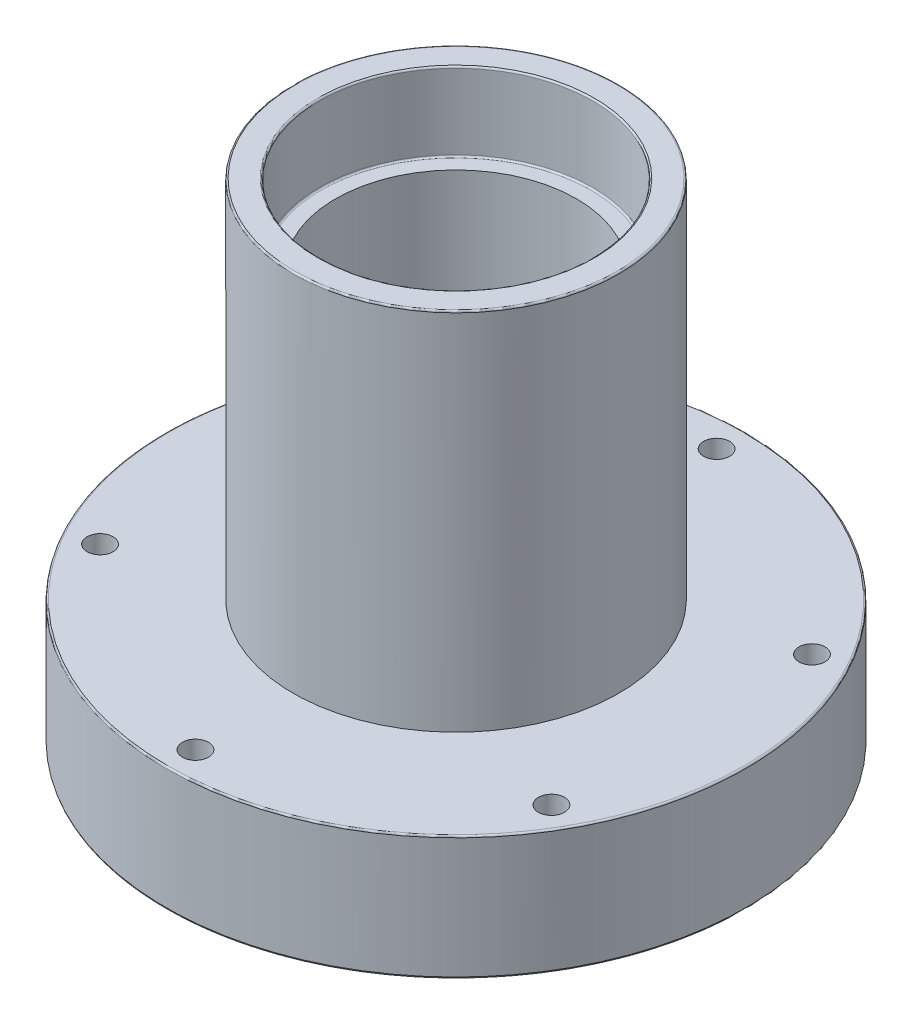
ISO-10303-21;
HEADER;
FILE_DESCRIPTION(('STEP AP214'),'2;1');
FILE_NAME('part.step','',(''),(''),'','','');
FILE_SCHEMA(('AUTOMOTIVE_DESIGN { 1 0 10303 214 1 1 1 1 }'));
ENDSEC;
DATA;
#1=APPLICATION_CONTEXT('core data for automotive mechanical design processes');
#2=APPLICATION_PROTOCOL_DEFINITION('international standard','automotive_design',2000,#1);
#3=PRODUCT_CONTEXT('',#1,'mechanical');
#4=PRODUCT('Part','Part','',(#3));
#5=PRODUCT_RELATED_PRODUCT_CATEGORY('part','',(#4));
#6=PRODUCT_DEFINITION_FORMATION('','',#4);
#7=PRODUCT_DEFINITION_CONTEXT('part definition',#1,'design');
#8=PRODUCT_DEFINITION('design','',#6,#7);
#9=PRODUCT_DEFINITION_SHAPE('','',#8);
#10=(LENGTH_UNIT() NAMED_UNIT(*) SI_UNIT(.MILLI.,.METRE.));
#11=(NAMED_UNIT(*) PLANE_ANGLE_UNIT() SI_UNIT($,.RADIAN.));
#12=(NAMED_UNIT(*) SI_UNIT($,.STERADIAN.) SOLID_ANGLE_UNIT());
#13=UNCERTAINTY_MEASURE_WITH_UNIT(LENGTH_MEASURE(1.E-05),#10,'distance_accuracy_value','');
#14=(GEOMETRIC_REPRESENTATION_CONTEXT(3) GLOBAL_UNCERTAINTY_ASSIGNED_CONTEXT((#13)) GLOBAL_UNIT_ASSIGNED_CONTEXT((#10,
#11,#12)) REPRESENTATION_CONTEXT('',''));
#15=CARTESIAN_POINT('',(0.,0.,0.));
#16=DIRECTION('',(0.,0.,1.));
#17=DIRECTION('',(1.,0.,0.));
#18=AXIS2_PLACEMENT_3D('',#15,#16,#17);
#19=CARTESIAN_POINT('',(0.,0.,-21.));
#20=DIRECTION('',(0.,-1.,0.));
#21=DIRECTION('',(0.,0.,-1.));
#22=AXIS2_PLACEMENT_3D('',#19,#20,#21);
#23=PLANE('',#22);
#24=CARTESIAN_POINT('',(0.,0.,0.));
#25=DIRECTION('',(0.,-1.,0.));
#26=DIRECTION('',(0.,0.,-1.));
#27=AXIS2_PLACEMENT_3D('',#24,#25,#26);
#28=CIRCLE('',#27,44.25);
#29=CARTESIAN_POINT('',(0.,0.,-44.25));
#30=VERTEX_POINT('',#29);
#31=EDGE_CURVE('E65',#30,#30,#28,.T.);
#32=ORIENTED_EDGE('',*,*,#31,.T.);
#33=EDGE_LOOP('',(#32));
#34=FACE_BOUND('',#33,.T.);
#35=CARTESIAN_POINT('',(0.,0.,-40.));
#36=DIRECTION('',(0.,1.,0.));
#37=DIRECTION('',(0.,0.,1.));
#38=AXIS2_PLACEMENT_3D('',#35,#36,#37);
#39=CIRCLE('',#38,2.);
#40=CARTESIAN_POINT('',(0.,0.,-38.));
#41=VERTEX_POINT('',#40);
#42=EDGE_CURVE('E89',#41,#41,#39,.T.);
#43=ORIENTED_EDGE('',*,*,#42,.T.);
#44=EDGE_LOOP('',(#43));
#45=FACE_BOUND('',#44,.T.);
#46=CARTESIAN_POINT('',(-34.6410161513776,0.,-20.));
#47=DIRECTION('',(0.,1.,0.));
#48=DIRECTION('',(0.,0.,1.));
#49=AXIS2_PLACEMENT_3D('',#46,#47,#48);
#50=CIRCLE('',#49,2.);
#51=CARTESIAN_POINT('',(-34.6410161513776,0.,-18.));
#52=VERTEX_POINT('',#51);
#53=EDGE_CURVE('E94',#52,#52,#50,.T.);
#54=ORIENTED_EDGE('',*,*,#53,.T.);
#55=EDGE_LOOP('',(#54));
#56=FACE_BOUND('',#55,.T.);
#57=CARTESIAN_POINT('',(-34.6410161513776,0.,20.));
#58=DIRECTION('',(0.,1.,0.));
#59=DIRECTION('',(0.,0.,1.));
#60=AXIS2_PLACEMENT_3D('',#57,#58,#59);
#61=CIRCLE('',#60,2.);
#62=CARTESIAN_POINT('',(-34.6410161513776,0.,22.));
#63=VERTEX_POINT('',#62);
#64=EDGE_CURVE('E93',#63,#63,#61,.T.);
#65=ORIENTED_EDGE('',*,*,#64,.T.);
#66=EDGE_LOOP('',(#65));
#67=FACE_BOUND('',#66,.T.);
#68=CARTESIAN_POINT('',(0.,0.,40.));
#69=DIRECTION('',(0.,1.,0.));
#70=DIRECTION('',(0.,0.,1.));
#71=AXIS2_PLACEMENT_3D('',#68,#69,#70);
#72=CIRCLE('',#71,2.);
#73=CARTESIAN_POINT('',(0.,0.,42.));
#74=VERTEX_POINT('',#73);
#75=EDGE_CURVE('E100',#74,#74,#72,.T.);
#76=ORIENTED_EDGE('',*,*,#75,.T.);
#77=EDGE_LOOP('',(#76));
#78=FACE_BOUND('',#77,.T.);
#79=CARTESIAN_POINT('',(34.6410161513776,0.,20.));
#80=DIRECTION('',(0.,1.,0.));
#81=DIRECTION('',(0.,0.,1.));
#82=AXIS2_PLACEMENT_3D('',#79,#80,#81);
#83=CIRCLE('',#82,2.00000000000001);
#84=CARTESIAN_POINT('',(34.6410161513776,0.,22.));
#85=VERTEX_POINT('',#84);
#86=EDGE_CURVE('E106',#85,#85,#83,.T.);
#87=ORIENTED_EDGE('',*,*,#86,.T.);
#88=EDGE_LOOP('',(#87));
#89=FACE_BOUND('',#88,.T.);
#90=CARTESIAN_POINT('',(34.6410161513775,0.,-20.));
#91=DIRECTION('',(0.,1.,0.));
#92=DIRECTION('',(0.,0.,1.));
#93=AXIS2_PLACEMENT_3D('',#90,#91,#92);
#94=CIRCLE('',#93,2.);
#95=CARTESIAN_POINT('',(34.6410161513775,0.,-18.));
#96=VERTEX_POINT('',#95);
#97=EDGE_CURVE('E112',#96,#96,#94,.T.);
#98=ORIENTED_EDGE('',*,*,#97,.T.);
#99=EDGE_LOOP('',(#98));
#100=FACE_BOUND('',#99,.T.);
#101=CARTESIAN_POINT('',(0.,0.,0.));
#102=DIRECTION('',(0.,-1.,0.));
#103=DIRECTION('',(0.,0.,-1.));
#104=AXIS2_PLACEMENT_3D('',#101,#102,#103);
#105=CIRCLE('',#104,21.);
#106=CARTESIAN_POINT('',(0.,0.,-21.));
#107=VERTEX_POINT('',#106);
#108=EDGE_CURVE('E77',#107,#107,#105,.T.);
#109=ORIENTED_EDGE('',*,*,#108,.F.);
#110=EDGE_LOOP('',(#109));
#111=FACE_BOUND('',#110,.T.);
#112=ADVANCED_FACE('F33',(#34,#45,#56,#67,#78,#89,#100,#111),#23,.T.);
#113=CARTESIAN_POINT('',(0.,-1000.23728813559,0.));
#114=DIRECTION('',(0.,-1.,0.));
#115=DIRECTION('',(0.,0.,-1.));
#116=AXIS2_PLACEMENT_3D('',#113,#114,#115);
#117=CYLINDRICAL_SURFACE('',#116,21.);
#118=CARTESIAN_POINT('',(0.,11.7499999999999,0.));
#119=DIRECTION('',(0.,-1.,0.));
#120=DIRECTION('',(0.,0.,-1.));
#121=AXIS2_PLACEMENT_3D('',#118,#119,#120);
#122=CIRCLE('',#121,21.);
#123=CARTESIAN_POINT('',(0.,11.7499999999999,-21.));
#124=VERTEX_POINT('',#123);
#125=EDGE_CURVE('E10',#124,#124,#122,.F.);
#126=ORIENTED_EDGE('',*,*,#125,.T.);
#127=EDGE_LOOP('',(#126));
#128=FACE_BOUND('',#127,.T.);
#129=ORIENTED_EDGE('',*,*,#108,.T.);
#130=EDGE_LOOP('',(#129));
#131=FACE_BOUND('',#130,.T.);
#132=ADVANCED_FACE('F166',(#128,#131),#117,.F.);
#133=CARTESIAN_POINT('',(0.,12.,-21.));
#134=DIRECTION('',(0.,-1.,0.));
#135=DIRECTION('',(0.,0.,-1.));
#136=AXIS2_PLACEMENT_3D('',#133,#134,#135);
#137=PLANE('',#136);
#138=CARTESIAN_POINT('',(0.,12.,0.));
#139=DIRECTION('',(0.,-1.,0.));
#140=DIRECTION('',(0.,0.,-1.));
#141=AXIS2_PLACEMENT_3D('',#138,#139,#140);
#142=CIRCLE('',#141,20.75);
#143=CARTESIAN_POINT('',(0.,12.,-20.75));
#144=VERTEX_POINT('',#143);
#145=EDGE_CURVE('E40',#144,#144,#142,.T.);
#146=ORIENTED_EDGE('',*,*,#145,.T.);
#147=EDGE_LOOP('',(#146));
#148=FACE_BOUND('',#147,.T.);
#149=CARTESIAN_POINT('',(0.,12.,0.));
#150=DIRECTION('',(0.,-1.,0.));
#151=DIRECTION('',(0.,0.,-1.));
#152=AXIS2_PLACEMENT_3D('',#149,#150,#151);
#153=CIRCLE('',#152,18.5);
#154=CARTESIAN_POINT('',(0.,12.,-18.5));
#155=VERTEX_POINT('',#154);
#156=EDGE_CURVE('E80',#155,#155,#153,.T.);
#157=ORIENTED_EDGE('',*,*,#156,.F.);
#158=EDGE_LOOP('',(#157));
#159=FACE_BOUND('',#158,.T.);
#160=ADVANCED_FACE('F172',(#148,#159),#137,.T.);
#161=CARTESIAN_POINT('',(0.,-1000.23728813559,0.));
#162=DIRECTION('',(0.,-1.,0.));
#163=DIRECTION('',(0.,0.,-1.));
#164=AXIS2_PLACEMENT_3D('',#161,#162,#163);
#165=CYLINDRICAL_SURFACE('',#164,18.5);
#166=ORIENTED_EDGE('',*,*,#156,.T.);
#167=EDGE_LOOP('',(#166));
#168=FACE_BOUND('',#167,.T.);
#169=CARTESIAN_POINT('',(0.,62.9999999999999,0.));
#170=DIRECTION('',(0.,-1.,0.));
#171=DIRECTION('',(0.,0.,-1.));
#172=AXIS2_PLACEMENT_3D('',#169,#170,#171);
#173=CIRCLE('',#172,18.5);
#174=CARTESIAN_POINT('',(0.,62.9999999999999,-18.5));
#175=VERTEX_POINT('',#174);
#176=EDGE_CURVE('E83',#175,#175,#173,.T.);
#177=ORIENTED_EDGE('',*,*,#176,.F.);
#178=EDGE_LOOP('',(#177));
#179=FACE_BOUND('',#178,.T.);
#180=ADVANCED_FACE('F208',(#168,#179),#165,.F.);
#181=CARTESIAN_POINT('',(0.,63.,-18.5));
#182=DIRECTION('',(0.,1.,0.));
#183=DIRECTION('',(0.,0.,1.));
#184=AXIS2_PLACEMENT_3D('',#181,#182,#183);
#185=PLANE('',#184);
#186=CARTESIAN_POINT('',(0.,63.,0.));
#187=DIRECTION('',(0.,1.,0.));
#188=DIRECTION('',(0.,0.,1.));
#189=AXIS2_PLACEMENT_3D('',#186,#187,#188);
#190=CIRCLE('',#189,20.75);
#191=CARTESIAN_POINT('',(0.,63.,20.75));
#192=VERTEX_POINT('',#191);
#193=EDGE_CURVE('E44',#192,#192,#190,.T.);
#194=ORIENTED_EDGE('',*,*,#193,.T.);
#195=EDGE_LOOP('',(#194));
#196=FACE_BOUND('',#195,.T.);
#197=ORIENTED_EDGE('',*,*,#176,.T.);
#198=EDGE_LOOP('',(#197));
#199=FACE_BOUND('',#198,.T.);
#200=ADVANCED_FACE('F202',(#196,#199),#185,.T.);
#201=CARTESIAN_POINT('',(0.,-1000.23728813559,0.));
#202=DIRECTION('',(0.,-1.,0.));
#203=DIRECTION('',(0.,0.,-1.));
#204=AXIS2_PLACEMENT_3D('',#201,#202,#203);
#205=CYLINDRICAL_SURFACE('',#204,21.);
#206=CARTESIAN_POINT('',(0.,74.7500000000001,0.));
#207=DIRECTION('',(0.,1.,0.));
#208=DIRECTION('',(0.,0.,1.));
#209=AXIS2_PLACEMENT_3D('',#206,#207,#208);
#210=CIRCLE('',#209,21.);
#211=CARTESIAN_POINT('',(0.,74.7500000000001,21.));
#212=VERTEX_POINT('',#211);
#213=EDGE_CURVE('E48',#212,#212,#210,.T.);
#214=ORIENTED_EDGE('',*,*,#213,.T.);
#215=EDGE_LOOP('',(#214));
#216=FACE_BOUND('',#215,.T.);
#217=CARTESIAN_POINT('',(0.,63.25,0.));
#218=DIRECTION('',(0.,1.,0.));
#219=DIRECTION('',(0.,0.,1.));
#220=AXIS2_PLACEMENT_3D('',#217,#218,#219);
#221=CIRCLE('',#220,21.);
#222=CARTESIAN_POINT('',(0.,63.25,21.));
#223=VERTEX_POINT('',#222);
#224=EDGE_CURVE('E53',#223,#223,#221,.F.);
#225=ORIENTED_EDGE('',*,*,#224,.T.);
#226=EDGE_LOOP('',(#225));
#227=FACE_BOUND('',#226,.T.);
#228=ADVANCED_FACE('F162',(#216,#227),#205,.F.);
#229=CARTESIAN_POINT('',(0.,75.,-21.));
#230=DIRECTION('',(0.,1.,0.));
#231=DIRECTION('',(0.,0.,1.));
#232=AXIS2_PLACEMENT_3D('',#229,#230,#231);
#233=PLANE('',#232);
#234=CARTESIAN_POINT('',(0.,75.,0.));
#235=DIRECTION('',(0.,1.,0.));
#236=DIRECTION('',(0.,0.,1.));
#237=AXIS2_PLACEMENT_3D('',#234,#235,#236);
#238=CIRCLE('',#237,24.75);
#239=CARTESIAN_POINT('',(0.,75.,24.75));
#240=VERTEX_POINT('',#239);
#241=EDGE_CURVE('E56',#240,#240,#238,.T.);
#242=ORIENTED_EDGE('',*,*,#241,.T.);
#243=EDGE_LOOP('',(#242));
#244=FACE_BOUND('',#243,.T.);
#245=CARTESIAN_POINT('',(0.,75.,0.));
#246=DIRECTION('',(0.,1.,0.));
#247=DIRECTION('',(0.,0.,1.));
#248=AXIS2_PLACEMENT_3D('',#245,#246,#247);
#249=CIRCLE('',#248,21.25);
#250=CARTESIAN_POINT('',(0.,75.,21.25));
#251=VERTEX_POINT('',#250);
#252=EDGE_CURVE('E59',#251,#251,#249,.F.);
#253=ORIENTED_EDGE('',*,*,#252,.T.);
#254=EDGE_LOOP('',(#253));
#255=FACE_BOUND('',#254,.T.);
#256=ADVANCED_FACE('F156',(#244,#255),#233,.T.);
#257=CARTESIAN_POINT('',(0.,-1000.23728813559,0.));
#258=DIRECTION('',(0.,-1.,0.));
#259=DIRECTION('',(0.,0.,-1.));
#260=AXIS2_PLACEMENT_3D('',#257,#258,#259);
#261=CYLINDRICAL_SURFACE('',#260,25.);
#262=CARTESIAN_POINT('',(0.,74.7500000000001,0.));
#263=DIRECTION('',(0.,1.,0.));
#264=DIRECTION('',(0.,0.,1.));
#265=AXIS2_PLACEMENT_3D('',#262,#263,#264);
#266=CIRCLE('',#265,25.);
#267=CARTESIAN_POINT('',(0.,74.7500000000001,25.));
#268=VERTEX_POINT('',#267);
#269=EDGE_CURVE('E62',#268,#268,#266,.F.);
#270=ORIENTED_EDGE('',*,*,#269,.T.);
#271=EDGE_LOOP('',(#270));
#272=FACE_BOUND('',#271,.T.);
#273=CARTESIAN_POINT('',(0.,18.9999999999999,0.));
#274=DIRECTION('',(0.,-1.,0.));
#275=DIRECTION('',(0.,0.,-1.));
#276=AXIS2_PLACEMENT_3D('',#273,#274,#275);
#277=CIRCLE('',#276,25.);
#278=CARTESIAN_POINT('',(0.,18.9999999999999,-25.));
#279=VERTEX_POINT('',#278);
#280=EDGE_CURVE('E86',#279,#279,#277,.T.);
#281=ORIENTED_EDGE('',*,*,#280,.F.);
#282=EDGE_LOOP('',(#281));
#283=FACE_BOUND('',#282,.T.);
#284=ADVANCED_FACE('F140',(#272,#283),#261,.T.);
#285=CARTESIAN_POINT('',(0.,19.,-25.));
#286=DIRECTION('',(0.,1.,0.));
#287=DIRECTION('',(0.,0.,1.));
#288=AXIS2_PLACEMENT_3D('',#285,#286,#287);
#289=PLANE('',#288);
#290=CARTESIAN_POINT('',(0.,19.,0.));
#291=DIRECTION('',(0.,1.,0.));
#292=DIRECTION('',(0.,0.,1.));
#293=AXIS2_PLACEMENT_3D('',#290,#291,#292);
#294=CIRCLE('',#293,44.25);
#295=CARTESIAN_POINT('',(0.,19.,44.25));
#296=VERTEX_POINT('',#295);
#297=EDGE_CURVE('E68',#296,#296,#294,.T.);
#298=ORIENTED_EDGE('',*,*,#297,.T.);
#299=EDGE_LOOP('',(#298));
#300=FACE_BOUND('',#299,.T.);
#301=CARTESIAN_POINT('',(0.,19.,-40.));
#302=DIRECTION('',(0.,1.,0.));
#303=DIRECTION('',(0.,0.,1.));
#304=AXIS2_PLACEMENT_3D('',#301,#302,#303);
#305=CIRCLE('',#304,2.);
#306=CARTESIAN_POINT('',(0.,19.,-38.));
#307=VERTEX_POINT('',#306);
#308=EDGE_CURVE('E115',#307,#307,#305,.T.);
#309=ORIENTED_EDGE('',*,*,#308,.F.);
#310=EDGE_LOOP('',(#309));
#311=FACE_BOUND('',#310,.T.);
#312=CARTESIAN_POINT('',(-34.6410161513776,19.,-20.));
#313=DIRECTION('',(0.,1.,0.));
#314=DIRECTION('',(0.,0.,1.));
#315=AXIS2_PLACEMENT_3D('',#312,#313,#314);
#316=CIRCLE('',#315,2.);
#317=CARTESIAN_POINT('',(-34.6410161513776,19.,-18.));
#318=VERTEX_POINT('',#317);
#319=EDGE_CURVE('E116',#318,#318,#316,.T.);
#320=ORIENTED_EDGE('',*,*,#319,.F.);
#321=EDGE_LOOP('',(#320));
#322=FACE_BOUND('',#321,.T.);
#323=CARTESIAN_POINT('',(-34.6410161513776,19.,20.));
#324=DIRECTION('',(0.,1.,0.));
#325=DIRECTION('',(0.,0.,1.));
#326=AXIS2_PLACEMENT_3D('',#323,#324,#325);
#327=CIRCLE('',#326,2.);
#328=CARTESIAN_POINT('',(-34.6410161513776,19.,22.));
#329=VERTEX_POINT('',#328);
#330=EDGE_CURVE('E90',#329,#329,#327,.T.);
#331=ORIENTED_EDGE('',*,*,#330,.F.);
#332=EDGE_LOOP('',(#331));
#333=FACE_BOUND('',#332,.T.);
#334=CARTESIAN_POINT('',(0.,19.,40.));
#335=DIRECTION('',(0.,1.,0.));
#336=DIRECTION('',(0.,0.,1.));
#337=AXIS2_PLACEMENT_3D('',#334,#335,#336);
#338=CIRCLE('',#337,2.);
#339=CARTESIAN_POINT('',(0.,19.,42.));
#340=VERTEX_POINT('',#339);
#341=EDGE_CURVE('E97',#340,#340,#338,.T.);
#342=ORIENTED_EDGE('',*,*,#341,.F.);
#343=EDGE_LOOP('',(#342));
#344=FACE_BOUND('',#343,.T.);
#345=CARTESIAN_POINT('',(34.6410161513776,19.,20.));
#346=DIRECTION('',(0.,1.,0.));
#347=DIRECTION('',(0.,0.,1.));
#348=AXIS2_PLACEMENT_3D('',#345,#346,#347);
#349=CIRCLE('',#348,2.00000000000001);
#350=CARTESIAN_POINT('',(34.6410161513776,19.,22.));
#351=VERTEX_POINT('',#350);
#352=EDGE_CURVE('E103',#351,#351,#349,.T.);
#353=ORIENTED_EDGE('',*,*,#352,.F.);
#354=EDGE_LOOP('',(#353));
#355=FACE_BOUND('',#354,.T.);
#356=CARTESIAN_POINT('',(34.6410161513775,19.,-20.));
#357=DIRECTION('',(0.,1.,0.));
#358=DIRECTION('',(0.,0.,1.));
#359=AXIS2_PLACEMENT_3D('',#356,#357,#358);
#360=CIRCLE('',#359,2.);
#361=CARTESIAN_POINT('',(34.6410161513775,19.,-18.));
#362=VERTEX_POINT('',#361);
#363=EDGE_CURVE('E109',#362,#362,#360,.T.);
#364=ORIENTED_EDGE('',*,*,#363,.F.);
#365=EDGE_LOOP('',(#364));
#366=FACE_BOUND('',#365,.T.);
#367=ORIENTED_EDGE('',*,*,#280,.T.);
#368=EDGE_LOOP('',(#367));
#369=FACE_BOUND('',#368,.T.);
#370=ADVANCED_FACE('F136',(#300,#311,#322,#333,#344,#355,#366,#369),#289,.T.);
#371=CARTESIAN_POINT('',(0.,-1000.23728813559,0.));
#372=DIRECTION('',(0.,-1.,0.));
#373=DIRECTION('',(0.,0.,-1.));
#374=AXIS2_PLACEMENT_3D('',#371,#372,#373);
#375=CYLINDRICAL_SURFACE('',#374,44.5);
#376=CARTESIAN_POINT('',(0.,18.75,0.));
#377=DIRECTION('',(0.,1.,0.));
#378=DIRECTION('',(0.,0.,1.));
#379=AXIS2_PLACEMENT_3D('',#376,#377,#378);
#380=CIRCLE('',#379,44.5);
#381=CARTESIAN_POINT('',(0.,18.75,44.5));
#382=VERTEX_POINT('',#381);
#383=EDGE_CURVE('E71',#382,#382,#380,.F.);
#384=ORIENTED_EDGE('',*,*,#383,.T.);
#385=EDGE_LOOP('',(#384));
#386=FACE_BOUND('',#385,.T.);
#387=CARTESIAN_POINT('',(0.,0.250000000000083,0.));
#388=DIRECTION('',(0.,-1.,0.));
#389=DIRECTION('',(0.,0.,-1.));
#390=AXIS2_PLACEMENT_3D('',#387,#388,#389);
#391=CIRCLE('',#390,44.5);
#392=CARTESIAN_POINT('',(0.,0.250000000000083,-44.5));
#393=VERTEX_POINT('',#392);
#394=EDGE_CURVE('E74',#393,#393,#391,.F.);
#395=ORIENTED_EDGE('',*,*,#394,.T.);
#396=EDGE_LOOP('',(#395));
#397=FACE_BOUND('',#396,.T.);
#398=ADVANCED_FACE('F139',(#386,#397),#375,.T.);
#399=CARTESIAN_POINT('',(34.6410161513775,0.,-20.));
#400=DIRECTION('',(0.,1.,0.));
#401=DIRECTION('',(0.,0.,1.));
#402=AXIS2_PLACEMENT_3D('',#399,#400,#401);
#403=CYLINDRICAL_SURFACE('',#402,2.);
#404=ORIENTED_EDGE('',*,*,#97,.F.);
#405=EDGE_LOOP('',(#404));
#406=FACE_BOUND('',#405,.T.);
#407=ORIENTED_EDGE('',*,*,#363,.T.);
#408=EDGE_LOOP('',(#407));
#409=FACE_BOUND('',#408,.T.);
#410=ADVANCED_FACE('F262',(#406,#409),#403,.F.);
#411=CARTESIAN_POINT('',(34.6410161513776,0.,20.));
#412=DIRECTION('',(0.,1.,0.));
#413=DIRECTION('',(0.,0.,1.));
#414=AXIS2_PLACEMENT_3D('',#411,#412,#413);
#415=CYLINDRICAL_SURFACE('',#414,2.00000000000001);
#416=ORIENTED_EDGE('',*,*,#86,.F.);
#417=EDGE_LOOP('',(#416));
#418=FACE_BOUND('',#417,.T.);
#419=ORIENTED_EDGE('',*,*,#352,.T.);
#420=EDGE_LOOP('',(#419));
#421=FACE_BOUND('',#420,.T.);
#422=ADVANCED_FACE('F327',(#418,#421),#415,.F.);
#423=CARTESIAN_POINT('',(0.,0.,40.));
#424=DIRECTION('',(0.,1.,0.));
#425=DIRECTION('',(0.,0.,1.));
#426=AXIS2_PLACEMENT_3D('',#423,#424,#425);
#427=CYLINDRICAL_SURFACE('',#426,2.);
#428=ORIENTED_EDGE('',*,*,#75,.F.);
#429=EDGE_LOOP('',(#428));
#430=FACE_BOUND('',#429,.T.);
#431=ORIENTED_EDGE('',*,*,#341,.T.);
#432=EDGE_LOOP('',(#431));
#433=FACE_BOUND('',#432,.T.);
#434=ADVANCED_FACE('F319',(#430,#433),#427,.F.);
#435=CARTESIAN_POINT('',(-34.6410161513776,0.,20.));
#436=DIRECTION('',(0.,1.,0.));
#437=DIRECTION('',(0.,0.,1.));
#438=AXIS2_PLACEMENT_3D('',#435,#436,#437);
#439=CYLINDRICAL_SURFACE('',#438,2.);
#440=ORIENTED_EDGE('',*,*,#64,.F.);
#441=EDGE_LOOP('',(#440));
#442=FACE_BOUND('',#441,.T.);
#443=ORIENTED_EDGE('',*,*,#330,.T.);
#444=EDGE_LOOP('',(#443));
#445=FACE_BOUND('',#444,.T.);
#446=ADVANCED_FACE('F311',(#442,#445),#439,.F.);
#447=CARTESIAN_POINT('',(-34.6410161513776,0.,-20.));
#448=DIRECTION('',(0.,1.,0.));
#449=DIRECTION('',(0.,0.,1.));
#450=AXIS2_PLACEMENT_3D('',#447,#448,#449);
#451=CYLINDRICAL_SURFACE('',#450,2.);
#452=ORIENTED_EDGE('',*,*,#53,.F.);
#453=EDGE_LOOP('',(#452));
#454=FACE_BOUND('',#453,.T.);
#455=ORIENTED_EDGE('',*,*,#319,.T.);
#456=EDGE_LOOP('',(#455));
#457=FACE_BOUND('',#456,.T.);
#458=ADVANCED_FACE('F132',(#454,#457),#451,.F.);
#459=CARTESIAN_POINT('',(0.,0.,-40.));
#460=DIRECTION('',(0.,1.,0.));
#461=DIRECTION('',(0.,0.,1.));
#462=AXIS2_PLACEMENT_3D('',#459,#460,#461);
#463=CYLINDRICAL_SURFACE('',#462,2.);
#464=ORIENTED_EDGE('',*,*,#42,.F.);
#465=EDGE_LOOP('',(#464));
#466=FACE_BOUND('',#465,.T.);
#467=ORIENTED_EDGE('',*,*,#308,.T.);
#468=EDGE_LOOP('',(#467));
#469=FACE_BOUND('',#468,.T.);
#470=ADVANCED_FACE('F128',(#466,#469),#463,.F.);
#471=CARTESIAN_POINT('',(0.,18.75,0.));
#472=DIRECTION('',(0.,1.,0.));
#473=DIRECTION('',(0.,0.,1.));
#474=AXIS2_PLACEMENT_3D('',#471,#472,#473);
#475=TOROIDAL_SURFACE('',#474,44.25,0.25);
#476=ORIENTED_EDGE('',*,*,#297,.F.);
#477=EDGE_LOOP('',(#476));
#478=FACE_BOUND('',#477,.T.);
#479=ORIENTED_EDGE('',*,*,#383,.F.);
#480=EDGE_LOOP('',(#479));
#481=FACE_BOUND('',#480,.T.);
#482=ADVANCED_FACE('F131',(#478,#481),#475,.T.);
#483=CARTESIAN_POINT('',(0.,0.250000000000083,0.));
#484=DIRECTION('',(0.,-1.,0.));
#485=DIRECTION('',(0.,0.,-1.));
#486=AXIS2_PLACEMENT_3D('',#483,#484,#485);
#487=TOROIDAL_SURFACE('',#486,44.25,0.25);
#488=ORIENTED_EDGE('',*,*,#394,.F.);
#489=EDGE_LOOP('',(#488));
#490=FACE_BOUND('',#489,.T.);
#491=ORIENTED_EDGE('',*,*,#31,.F.);
#492=EDGE_LOOP('',(#491));
#493=FACE_BOUND('',#492,.T.);
#494=ADVANCED_FACE('F178',(#490,#493),#487,.T.);
#495=CARTESIAN_POINT('',(0.,74.7500000000001,0.));
#496=DIRECTION('',(0.,1.,0.));
#497=DIRECTION('',(0.,0.,1.));
#498=AXIS2_PLACEMENT_3D('',#495,#496,#497);
#499=TOROIDAL_SURFACE('',#498,24.75,0.25);
#500=ORIENTED_EDGE('',*,*,#241,.F.);
#501=EDGE_LOOP('',(#500));
#502=FACE_BOUND('',#501,.T.);
#503=ORIENTED_EDGE('',*,*,#269,.F.);
#504=EDGE_LOOP('',(#503));
#505=FACE_BOUND('',#504,.T.);
#506=ADVANCED_FACE('F182',(#502,#505),#499,.T.);
#507=CARTESIAN_POINT('',(0.,74.7500000000001,0.));
#508=DIRECTION('',(0.,1.,0.));
#509=DIRECTION('',(0.,0.,1.));
#510=AXIS2_PLACEMENT_3D('',#507,#508,#509);
#511=TOROIDAL_SURFACE('',#510,21.25,0.25);
#512=ORIENTED_EDGE('',*,*,#213,.F.);
#513=EDGE_LOOP('',(#512));
#514=FACE_BOUND('',#513,.T.);
#515=ORIENTED_EDGE('',*,*,#252,.F.);
#516=EDGE_LOOP('',(#515));
#517=FACE_BOUND('',#516,.T.);
#518=ADVANCED_FACE('F186',(#514,#517),#511,.T.);
#519=CARTESIAN_POINT('',(0.,63.25,0.));
#520=DIRECTION('',(0.,1.,0.));
#521=DIRECTION('',(0.,0.,1.));
#522=AXIS2_PLACEMENT_3D('',#519,#520,#521);
#523=TOROIDAL_SURFACE('',#522,20.75,0.25);
#524=ORIENTED_EDGE('',*,*,#193,.F.);
#525=EDGE_LOOP('',(#524));
#526=FACE_BOUND('',#525,.T.);
#527=ORIENTED_EDGE('',*,*,#224,.F.);
#528=EDGE_LOOP('',(#527));
#529=FACE_BOUND('',#528,.T.);
#530=ADVANCED_FACE('F189',(#526,#529),#523,.F.);
#531=CARTESIAN_POINT('',(0.,11.7499999999999,0.));
#532=DIRECTION('',(0.,-1.,0.));
#533=DIRECTION('',(0.,0.,-1.));
#534=AXIS2_PLACEMENT_3D('',#531,#532,#533);
#535=TOROIDAL_SURFACE('',#534,20.75,0.25);
#536=ORIENTED_EDGE('',*,*,#125,.F.);
#537=EDGE_LOOP('',(#536));
#538=FACE_BOUND('',#537,.T.);
#539=ORIENTED_EDGE('',*,*,#145,.F.);
#540=EDGE_LOOP('',(#539));
#541=FACE_BOUND('',#540,.T.);
#542=ADVANCED_FACE('F35',(#538,#541),#535,.F.);
#543=CLOSED_SHELL('',(#112,#132,#160,#180,#200,#228,#256,#284,#370,#398,#410,#422,#434,#446,
#458,#470,#482,#494,#506,#518,#530,#542));
#544=MANIFOLD_SOLID_BREP('B2',#543);
#545=ADVANCED_BREP_SHAPE_REPRESENTATION('',(#18,#544),#14);
#546=SHAPE_DEFINITION_REPRESENTATION(#9,#545);
ENDSEC;
END-ISO-10303-21;
